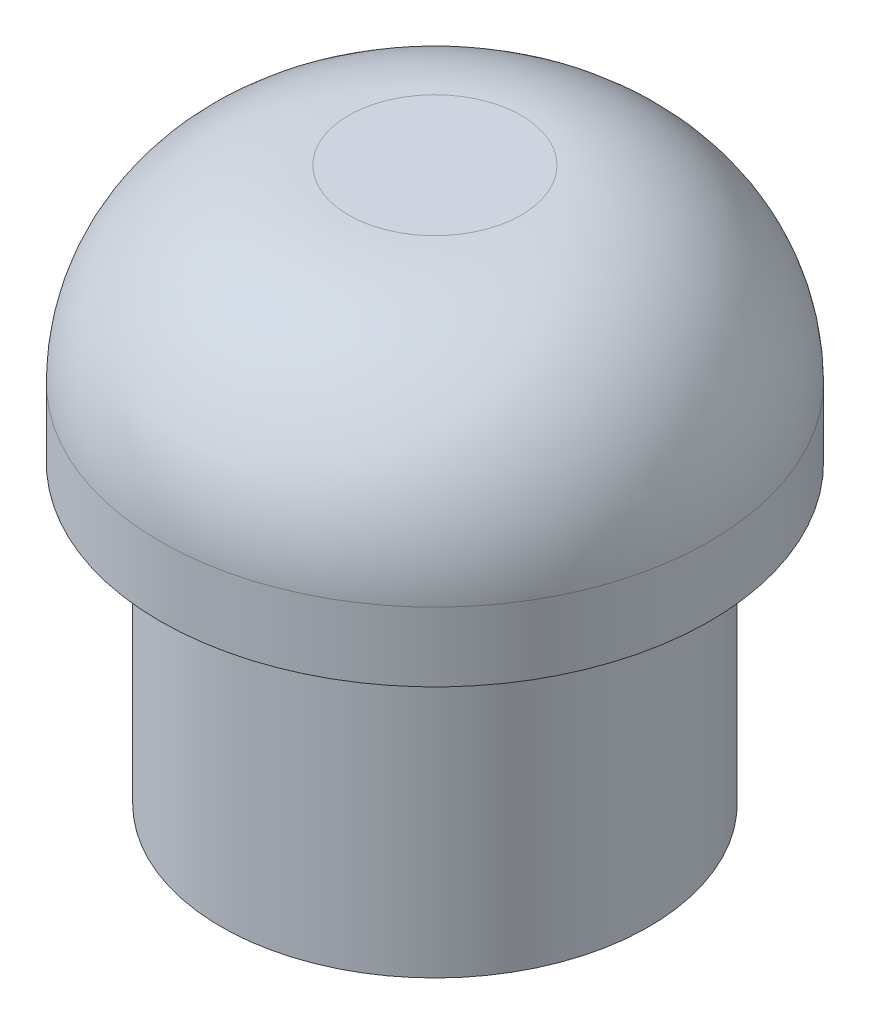
ISO-10303-21;
HEADER;
FILE_DESCRIPTION(('STEP AP214'),'2;1');
FILE_NAME('part.step','',(''),(''),'','','');
FILE_SCHEMA(('AUTOMOTIVE_DESIGN { 1 0 10303 214 1 1 1 1 }'));
ENDSEC;
DATA;
#1=APPLICATION_CONTEXT('core data for automotive mechanical design processes');
#2=APPLICATION_PROTOCOL_DEFINITION('international standard','automotive_design',2000,#1);
#3=PRODUCT_CONTEXT('',#1,'mechanical');
#4=PRODUCT('Part','Part','',(#3));
#5=PRODUCT_RELATED_PRODUCT_CATEGORY('part','',(#4));
#6=PRODUCT_DEFINITION_FORMATION('','',#4);
#7=PRODUCT_DEFINITION_CONTEXT('part definition',#1,'design');
#8=PRODUCT_DEFINITION('design','',#6,#7);
#9=PRODUCT_DEFINITION_SHAPE('','',#8);
#10=(LENGTH_UNIT() NAMED_UNIT(*) SI_UNIT(.MILLI.,.METRE.));
#11=(NAMED_UNIT(*) PLANE_ANGLE_UNIT() SI_UNIT($,.RADIAN.));
#12=(NAMED_UNIT(*) SI_UNIT($,.STERADIAN.) SOLID_ANGLE_UNIT());
#13=UNCERTAINTY_MEASURE_WITH_UNIT(LENGTH_MEASURE(1.E-05),#10,'distance_accuracy_value','');
#14=(GEOMETRIC_REPRESENTATION_CONTEXT(3) GLOBAL_UNCERTAINTY_ASSIGNED_CONTEXT((#13)) GLOBAL_UNIT_ASSIGNED_CONTEXT((#10,
#11,#12)) REPRESENTATION_CONTEXT('',''));
#15=CARTESIAN_POINT('',(0.,0.,0.));
#16=DIRECTION('',(0.,0.,1.));
#17=DIRECTION('',(1.,0.,0.));
#18=AXIS2_PLACEMENT_3D('',#15,#16,#17);
#19=CARTESIAN_POINT('',(0.,0.,0.));
#20=DIRECTION('',(0.,1.,0.));
#21=DIRECTION('',(0.,0.,1.));
#22=AXIS2_PLACEMENT_3D('',#19,#20,#21);
#23=PLANE('',#22);
#24=CARTESIAN_POINT('',(0.,0.,0.));
#25=DIRECTION('',(0.,1.,0.));
#26=DIRECTION('',(0.,0.,1.));
#27=AXIS2_PLACEMENT_3D('',#24,#25,#26);
#28=CIRCLE('',#27,8.75);
#29=CARTESIAN_POINT('',(0.,0.,8.75));
#30=VERTEX_POINT('',#29);
#31=EDGE_CURVE('E79',#30,#30,#28,.T.);
#32=ORIENTED_EDGE('',*,*,#31,.F.);
#33=EDGE_LOOP('',(#32));
#34=FACE_BOUND('',#33,.T.);
#35=CARTESIAN_POINT('',(0.,0.,0.));
#36=DIRECTION('',(0.,-1.,0.));
#37=DIRECTION('',(0.,0.,-1.));
#38=AXIS2_PLACEMENT_3D('',#35,#36,#37);
#39=CIRCLE('',#38,6.80684574158332);
#40=CARTESIAN_POINT('',(4.29201934192807,0.,-5.28315425841668));
#41=VERTEX_POINT('',#40);
#42=CARTESIAN_POINT('',(-4.29201934192807,0.,-5.28315425841668));
#43=VERTEX_POINT('',#42);
#44=EDGE_CURVE('E48',#41,#43,#39,.T.);
#45=ORIENTED_EDGE('',*,*,#44,.F.);
#46=DIRECTION('',(-1.,0.,0.));
#47=VECTOR('',#46,1.);
#48=CARTESIAN_POINT('',(0.,0.,-5.28315425841668));
#49=LINE('',#48,#47);
#50=EDGE_CURVE('E62',#41,#43,#49,.T.);
#51=ORIENTED_EDGE('',*,*,#50,.T.);
#52=EDGE_LOOP('',(#45,#51));
#53=FACE_BOUND('',#52,.T.);
#54=ADVANCED_FACE('F34',(#34,#53),#23,.F.);
#55=CARTESIAN_POINT('',(0.,8.2,0.));
#56=DIRECTION('',(0.,-1.,0.));
#57=DIRECTION('',(0.,0.,-1.));
#58=AXIS2_PLACEMENT_3D('',#55,#56,#57);
#59=CYLINDRICAL_SURFACE('',#58,8.75);
#60=CARTESIAN_POINT('',(0.,2.2,0.));
#61=DIRECTION('',(0.,1.,0.));
#62=DIRECTION('',(0.,0.,1.));
#63=AXIS2_PLACEMENT_3D('',#60,#61,#62);
#64=CIRCLE('',#63,8.75);
#65=CARTESIAN_POINT('',(0.,2.2,8.75));
#66=VERTEX_POINT('',#65);
#67=EDGE_CURVE('E11',#66,#66,#64,.F.);
#68=ORIENTED_EDGE('',*,*,#67,.T.);
#69=EDGE_LOOP('',(#68));
#70=FACE_BOUND('',#69,.T.);
#71=ORIENTED_EDGE('',*,*,#31,.T.);
#72=EDGE_LOOP('',(#71));
#73=FACE_BOUND('',#72,.T.);
#74=ADVANCED_FACE('F93',(#70,#73),#59,.T.);
#75=CARTESIAN_POINT('',(0.,8.2,0.));
#76=DIRECTION('',(0.,1.,0.));
#77=DIRECTION('',(0.,0.,1.));
#78=AXIS2_PLACEMENT_3D('',#75,#76,#77);
#79=PLANE('',#78);
#80=CARTESIAN_POINT('',(0.,8.2,0.));
#81=DIRECTION('',(0.,1.,0.));
#82=DIRECTION('',(0.,0.,1.));
#83=AXIS2_PLACEMENT_3D('',#80,#81,#82);
#84=CIRCLE('',#83,2.75);
#85=CARTESIAN_POINT('',(0.,8.2,2.75));
#86=VERTEX_POINT('',#85);
#87=EDGE_CURVE('E42',#86,#86,#84,.T.);
#88=ORIENTED_EDGE('',*,*,#87,.T.);
#89=EDGE_LOOP('',(#88));
#90=FACE_BOUND('',#89,.T.);
#91=ADVANCED_FACE('F84',(#90),#79,.T.);
#92=CARTESIAN_POINT('',(0.,2.2,0.));
#93=DIRECTION('',(0.,1.,0.));
#94=DIRECTION('',(0.,0.,1.));
#95=AXIS2_PLACEMENT_3D('',#92,#93,#94);
#96=DEGENERATE_TOROIDAL_SURFACE('',#95,2.75,6.,.T.);
#97=ORIENTED_EDGE('',*,*,#67,.F.);
#98=EDGE_LOOP('',(#97));
#99=FACE_BOUND('',#98,.T.);
#100=ORIENTED_EDGE('',*,*,#87,.F.);
#101=EDGE_LOOP('',(#100));
#102=FACE_BOUND('',#101,.T.);
#103=ADVANCED_FACE('F36',(#99,#102),#96,.T.);
#104=CARTESIAN_POINT('',(0.,-9.4,-5.28315425841668));
#105=DIRECTION('',(0.,0.,-1.));
#106=DIRECTION('',(-1.,0.,0.));
#107=AXIS2_PLACEMENT_3D('',#104,#105,#106);
#108=PLANE('',#107);
#109=ORIENTED_EDGE('',*,*,#50,.F.);
#110=DIRECTION('',(0.,1.,0.));
#111=VECTOR('',#110,1.);
#112=CARTESIAN_POINT('',(4.29201934192807,-9.4,-5.28315425841668));
#113=LINE('',#112,#111);
#114=CARTESIAN_POINT('',(4.29201934192807,-9.4,-5.28315425841668));
#115=VERTEX_POINT('',#114);
#116=EDGE_CURVE('E71',#115,#41,#113,.T.);
#117=ORIENTED_EDGE('',*,*,#116,.F.);
#118=DIRECTION('',(-1.,0.,0.));
#119=VECTOR('',#118,1.);
#120=CARTESIAN_POINT('',(0.,-9.4,-5.28315425841668));
#121=LINE('',#120,#119);
#122=CARTESIAN_POINT('',(-4.29201934192807,-9.4,-5.28315425841668));
#123=VERTEX_POINT('',#122);
#124=EDGE_CURVE('E69',#115,#123,#121,.T.);
#125=ORIENTED_EDGE('',*,*,#124,.T.);
#126=DIRECTION('',(0.,1.,0.));
#127=VECTOR('',#126,1.);
#128=CARTESIAN_POINT('',(-4.29201934192807,-9.4,-5.28315425841668));
#129=LINE('',#128,#127);
#130=EDGE_CURVE('E67',#123,#43,#129,.T.);
#131=ORIENTED_EDGE('',*,*,#130,.T.);
#132=EDGE_LOOP('',(#109,#117,#125,#131));
#133=FACE_BOUND('',#132,.T.);
#134=ADVANCED_FACE('F68',(#133),#108,.T.);
#135=CARTESIAN_POINT('',(0.,-9.4,0.));
#136=DIRECTION('',(0.,1.,0.));
#137=DIRECTION('',(0.,0.,1.));
#138=AXIS2_PLACEMENT_3D('',#135,#136,#137);
#139=CYLINDRICAL_SURFACE('',#138,6.80684574158332);
#140=ORIENTED_EDGE('',*,*,#44,.T.);
#141=ORIENTED_EDGE('',*,*,#130,.F.);
#142=CARTESIAN_POINT('',(0.,-9.4,0.));
#143=DIRECTION('',(0.,-1.,0.));
#144=DIRECTION('',(0.,0.,-1.));
#145=AXIS2_PLACEMENT_3D('',#142,#143,#144);
#146=CIRCLE('',#145,6.80684574158332);
#147=EDGE_CURVE('E56',#115,#123,#146,.T.);
#148=ORIENTED_EDGE('',*,*,#147,.F.);
#149=ORIENTED_EDGE('',*,*,#116,.T.);
#150=EDGE_LOOP('',(#140,#141,#148,#149));
#151=FACE_BOUND('',#150,.T.);
#152=ADVANCED_FACE('F73',(#151),#139,.T.);
#153=CARTESIAN_POINT('',(0.,-9.4,0.));
#154=DIRECTION('',(0.,-1.,0.));
#155=DIRECTION('',(0.,0.,-1.));
#156=AXIS2_PLACEMENT_3D('',#153,#154,#155);
#157=PLANE('',#156);
#158=ORIENTED_EDGE('',*,*,#124,.F.);
#159=ORIENTED_EDGE('',*,*,#147,.T.);
#160=EDGE_LOOP('',(#158,#159));
#161=FACE_BOUND('',#160,.T.);
#162=ADVANCED_FACE('F107',(#161),#157,.T.);
#163=CLOSED_SHELL('',(#54,#74,#91,#103,#134,#152,#162));
#164=MANIFOLD_SOLID_BREP('B2',#163);
#165=ADVANCED_BREP_SHAPE_REPRESENTATION('',(#18,#164),#14);
#166=SHAPE_DEFINITION_REPRESENTATION(#9,#165);
ENDSEC;
END-ISO-10303-21;
